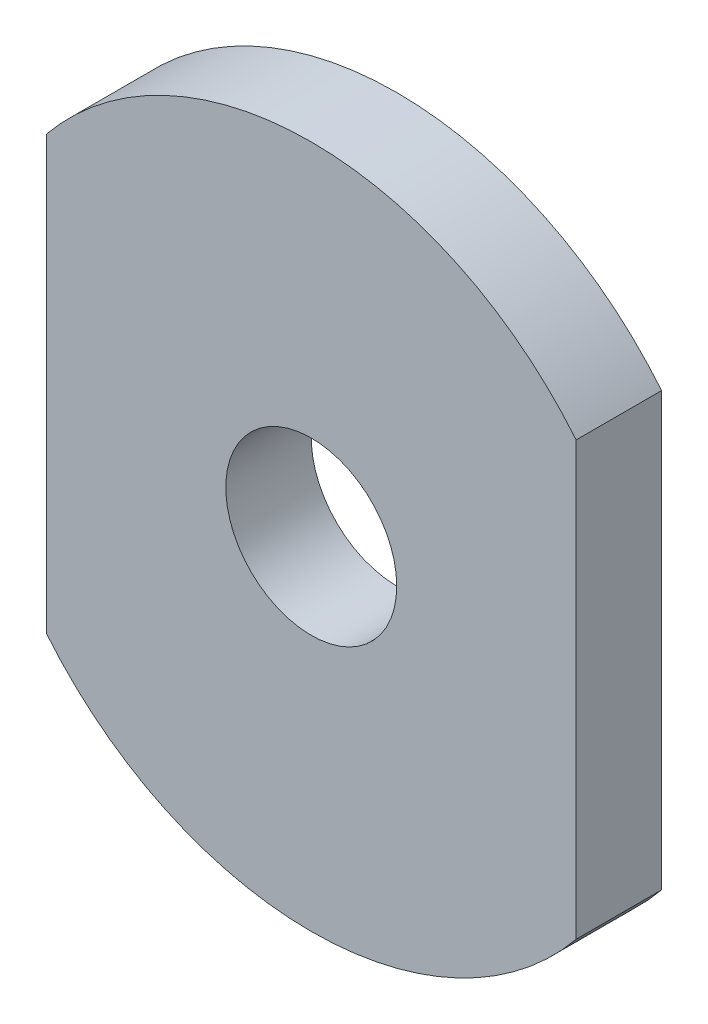
ISO-10303-21;
HEADER;
FILE_DESCRIPTION(('STEP AP214'),'2;1');
FILE_NAME('part.step','',(''),(''),'','','');
FILE_SCHEMA(('AUTOMOTIVE_DESIGN { 1 0 10303 214 1 1 1 1 }'));
ENDSEC;
DATA;
#1=APPLICATION_CONTEXT('core data for automotive mechanical design processes');
#2=APPLICATION_PROTOCOL_DEFINITION('international standard','automotive_design',2000,#1);
#3=PRODUCT_CONTEXT('',#1,'mechanical');
#4=PRODUCT('Part','Part','',(#3));
#5=PRODUCT_RELATED_PRODUCT_CATEGORY('part','',(#4));
#6=PRODUCT_DEFINITION_FORMATION('','',#4);
#7=PRODUCT_DEFINITION_CONTEXT('part definition',#1,'design');
#8=PRODUCT_DEFINITION('design','',#6,#7);
#9=PRODUCT_DEFINITION_SHAPE('','',#8);
#10=(LENGTH_UNIT() NAMED_UNIT(*) SI_UNIT(.MILLI.,.METRE.));
#11=(NAMED_UNIT(*) PLANE_ANGLE_UNIT() SI_UNIT($,.RADIAN.));
#12=(NAMED_UNIT(*) SI_UNIT($,.STERADIAN.) SOLID_ANGLE_UNIT());
#13=UNCERTAINTY_MEASURE_WITH_UNIT(LENGTH_MEASURE(1.E-05),#10,'distance_accuracy_value','');
#14=(GEOMETRIC_REPRESENTATION_CONTEXT(3) GLOBAL_UNCERTAINTY_ASSIGNED_CONTEXT((#13)) GLOBAL_UNIT_ASSIGNED_CONTEXT((#10,
#11,#12)) REPRESENTATION_CONTEXT('',''));
#15=CARTESIAN_POINT('',(0.,0.,0.));
#16=DIRECTION('',(0.,0.,1.));
#17=DIRECTION('',(1.,0.,0.));
#18=AXIS2_PLACEMENT_3D('',#15,#16,#17);
#19=CARTESIAN_POINT('',(0.,0.,5.));
#20=DIRECTION('',(0.,0.,1.));
#21=DIRECTION('',(1.,0.,0.));
#22=AXIS2_PLACEMENT_3D('',#19,#20,#21);
#23=PLANE('',#22);
#24=CARTESIAN_POINT('',(0.,0.,5.));
#25=DIRECTION('',(0.,0.,1.));
#26=DIRECTION('',(1.,0.,0.));
#27=AXIS2_PLACEMENT_3D('',#24,#25,#26);
#28=CIRCLE('',#27,20.);
#29=CARTESIAN_POINT('',(15.4927529048047,12.6481068714123,5.));
#30=VERTEX_POINT('',#29);
#31=CARTESIAN_POINT('',(-15.4927529048047,12.6481068714123,5.));
#32=VERTEX_POINT('',#31);
#33=EDGE_CURVE('E91',#30,#32,#28,.T.);
#34=ORIENTED_EDGE('',*,*,#33,.T.);
#35=DIRECTION('',(0.,-1.,0.));
#36=VECTOR('',#35,1.);
#37=CARTESIAN_POINT('',(-15.4927529048047,12.6481068714123,5.));
#38=LINE('',#37,#36);
#39=CARTESIAN_POINT('',(-15.4927529048047,-12.6481068714123,5.));
#40=VERTEX_POINT('',#39);
#41=EDGE_CURVE('E86',#32,#40,#38,.T.);
#42=ORIENTED_EDGE('',*,*,#41,.T.);
#43=CARTESIAN_POINT('',(0.,0.,5.));
#44=DIRECTION('',(0.,0.,1.));
#45=DIRECTION('',(1.,0.,0.));
#46=AXIS2_PLACEMENT_3D('',#43,#44,#45);
#47=CIRCLE('',#46,20.);
#48=CARTESIAN_POINT('',(15.4927529048047,-12.6481068714123,5.));
#49=VERTEX_POINT('',#48);
#50=EDGE_CURVE('E89',#40,#49,#47,.T.);
#51=ORIENTED_EDGE('',*,*,#50,.T.);
#52=DIRECTION('',(0.,1.,0.));
#53=VECTOR('',#52,1.);
#54=CARTESIAN_POINT('',(15.4927529048047,12.6481068714123,5.));
#55=LINE('',#54,#53);
#56=EDGE_CURVE('E56',#49,#30,#55,.T.);
#57=ORIENTED_EDGE('',*,*,#56,.T.);
#58=EDGE_LOOP('',(#34,#42,#51,#57));
#59=FACE_BOUND('',#58,.T.);
#60=CARTESIAN_POINT('',(0.,0.,5.));
#61=DIRECTION('',(0.,0.,1.));
#62=DIRECTION('',(1.,0.,0.));
#63=AXIS2_PLACEMENT_3D('',#60,#61,#62);
#64=CIRCLE('',#63,5.);
#65=CARTESIAN_POINT('',(5.,0.,5.));
#66=VERTEX_POINT('',#65);
#67=EDGE_CURVE('E106',#66,#66,#64,.T.);
#68=ORIENTED_EDGE('',*,*,#67,.F.);
#69=EDGE_LOOP('',(#68));
#70=FACE_BOUND('',#69,.T.);
#71=ADVANCED_FACE('F39',(#59,#70),#23,.T.);
#72=CARTESIAN_POINT('',(0.,0.,0.));
#73=DIRECTION('',(0.,0.,1.));
#74=DIRECTION('',(1.,0.,0.));
#75=AXIS2_PLACEMENT_3D('',#72,#73,#74);
#76=PLANE('',#75);
#77=CARTESIAN_POINT('',(0.,0.,0.));
#78=DIRECTION('',(0.,0.,1.));
#79=DIRECTION('',(1.,0.,0.));
#80=AXIS2_PLACEMENT_3D('',#77,#78,#79);
#81=CIRCLE('',#80,20.);
#82=CARTESIAN_POINT('',(15.4927529048047,12.6481068714123,0.));
#83=VERTEX_POINT('',#82);
#84=CARTESIAN_POINT('',(-15.4927529048047,12.6481068714123,0.));
#85=VERTEX_POINT('',#84);
#86=EDGE_CURVE('E103',#83,#85,#81,.T.);
#87=ORIENTED_EDGE('',*,*,#86,.F.);
#88=DIRECTION('',(0.,1.,0.));
#89=VECTOR('',#88,1.);
#90=CARTESIAN_POINT('',(15.4927529048047,12.6481068714123,0.));
#91=LINE('',#90,#89);
#92=CARTESIAN_POINT('',(15.4927529048047,-12.6481068714123,0.));
#93=VERTEX_POINT('',#92);
#94=EDGE_CURVE('E79',#93,#83,#91,.T.);
#95=ORIENTED_EDGE('',*,*,#94,.F.);
#96=CARTESIAN_POINT('',(0.,0.,0.));
#97=DIRECTION('',(0.,0.,1.));
#98=DIRECTION('',(1.,0.,0.));
#99=AXIS2_PLACEMENT_3D('',#96,#97,#98);
#100=CIRCLE('',#99,20.);
#101=CARTESIAN_POINT('',(-15.4927529048047,-12.6481068714123,0.));
#102=VERTEX_POINT('',#101);
#103=EDGE_CURVE('E73',#102,#93,#100,.T.);
#104=ORIENTED_EDGE('',*,*,#103,.F.);
#105=DIRECTION('',(0.,-1.,0.));
#106=VECTOR('',#105,1.);
#107=CARTESIAN_POINT('',(-15.4927529048047,12.6481068714123,0.));
#108=LINE('',#107,#106);
#109=EDGE_CURVE('E95',#85,#102,#108,.T.);
#110=ORIENTED_EDGE('',*,*,#109,.F.);
#111=EDGE_LOOP('',(#87,#95,#104,#110));
#112=FACE_BOUND('',#111,.T.);
#113=CARTESIAN_POINT('',(0.,0.,0.));
#114=DIRECTION('',(0.,0.,1.));
#115=DIRECTION('',(1.,0.,0.));
#116=AXIS2_PLACEMENT_3D('',#113,#114,#115);
#117=CIRCLE('',#116,5.);
#118=CARTESIAN_POINT('',(5.,0.,0.));
#119=VERTEX_POINT('',#118);
#120=EDGE_CURVE('E118',#119,#119,#117,.T.);
#121=ORIENTED_EDGE('',*,*,#120,.T.);
#122=EDGE_LOOP('',(#121));
#123=FACE_BOUND('',#122,.T.);
#124=ADVANCED_FACE('F114',(#112,#123),#76,.F.);
#125=CARTESIAN_POINT('',(0.,0.,5.));
#126=DIRECTION('',(0.,0.,-1.));
#127=DIRECTION('',(-1.,0.,0.));
#128=AXIS2_PLACEMENT_3D('',#125,#126,#127);
#129=CYLINDRICAL_SURFACE('',#128,20.);
#130=ORIENTED_EDGE('',*,*,#86,.T.);
#131=DIRECTION('',(0.,0.,-1.));
#132=VECTOR('',#131,1.);
#133=CARTESIAN_POINT('',(-15.4927529048047,12.6481068714123,5.));
#134=LINE('',#133,#132);
#135=EDGE_CURVE('E11',#32,#85,#134,.T.);
#136=ORIENTED_EDGE('',*,*,#135,.F.);
#137=ORIENTED_EDGE('',*,*,#33,.F.);
#138=DIRECTION('',(0.,0.,-1.));
#139=VECTOR('',#138,1.);
#140=CARTESIAN_POINT('',(15.4927529048047,12.6481068714123,5.));
#141=LINE('',#140,#139);
#142=EDGE_CURVE('E99',#30,#83,#141,.T.);
#143=ORIENTED_EDGE('',*,*,#142,.T.);
#144=EDGE_LOOP('',(#130,#136,#137,#143));
#145=FACE_BOUND('',#144,.T.);
#146=ADVANCED_FACE('F41',(#145),#129,.T.);
#147=CARTESIAN_POINT('',(-15.4927529048047,12.6481068714123,5.));
#148=DIRECTION('',(1.,0.,0.));
#149=DIRECTION('',(0.,0.,-1.));
#150=AXIS2_PLACEMENT_3D('',#147,#148,#149);
#151=PLANE('',#150);
#152=ORIENTED_EDGE('',*,*,#109,.T.);
#153=DIRECTION('',(0.,0.,-1.));
#154=VECTOR('',#153,1.);
#155=CARTESIAN_POINT('',(-15.4927529048047,-12.6481068714123,5.));
#156=LINE('',#155,#154);
#157=EDGE_CURVE('E48',#40,#102,#156,.T.);
#158=ORIENTED_EDGE('',*,*,#157,.F.);
#159=ORIENTED_EDGE('',*,*,#41,.F.);
#160=ORIENTED_EDGE('',*,*,#135,.T.);
#161=EDGE_LOOP('',(#152,#158,#159,#160));
#162=FACE_BOUND('',#161,.T.);
#163=ADVANCED_FACE('F94',(#162),#151,.F.);
#164=CARTESIAN_POINT('',(0.,0.,5.));
#165=DIRECTION('',(0.,0.,-1.));
#166=DIRECTION('',(-1.,0.,0.));
#167=AXIS2_PLACEMENT_3D('',#164,#165,#166);
#168=CYLINDRICAL_SURFACE('',#167,20.);
#169=ORIENTED_EDGE('',*,*,#103,.T.);
#170=DIRECTION('',(0.,0.,-1.));
#171=VECTOR('',#170,1.);
#172=CARTESIAN_POINT('',(15.4927529048047,-12.6481068714123,5.));
#173=LINE('',#172,#171);
#174=EDGE_CURVE('E96',#49,#93,#173,.T.);
#175=ORIENTED_EDGE('',*,*,#174,.F.);
#176=ORIENTED_EDGE('',*,*,#50,.F.);
#177=ORIENTED_EDGE('',*,*,#157,.T.);
#178=EDGE_LOOP('',(#169,#175,#176,#177));
#179=FACE_BOUND('',#178,.T.);
#180=ADVANCED_FACE('F97',(#179),#168,.T.);
#181=CARTESIAN_POINT('',(15.4927529048047,12.6481068714123,5.));
#182=DIRECTION('',(-1.,0.,0.));
#183=DIRECTION('',(0.,0.,1.));
#184=AXIS2_PLACEMENT_3D('',#181,#182,#183);
#185=PLANE('',#184);
#186=ORIENTED_EDGE('',*,*,#94,.T.);
#187=ORIENTED_EDGE('',*,*,#142,.F.);
#188=ORIENTED_EDGE('',*,*,#56,.F.);
#189=ORIENTED_EDGE('',*,*,#174,.T.);
#190=EDGE_LOOP('',(#186,#187,#188,#189));
#191=FACE_BOUND('',#190,.T.);
#192=ADVANCED_FACE('F111',(#191),#185,.F.);
#193=CARTESIAN_POINT('',(0.,0.,5.));
#194=DIRECTION('',(0.,0.,-1.));
#195=DIRECTION('',(-1.,0.,0.));
#196=AXIS2_PLACEMENT_3D('',#193,#194,#195);
#197=CYLINDRICAL_SURFACE('',#196,5.);
#198=ORIENTED_EDGE('',*,*,#67,.T.);
#199=EDGE_LOOP('',(#198));
#200=FACE_BOUND('',#199,.T.);
#201=ORIENTED_EDGE('',*,*,#120,.F.);
#202=EDGE_LOOP('',(#201));
#203=FACE_BOUND('',#202,.T.);
#204=ADVANCED_FACE('F124',(#200,#203),#197,.F.);
#205=CLOSED_SHELL('',(#71,#124,#146,#163,#180,#192,#204));
#206=MANIFOLD_SOLID_BREP('B2',#205);
#207=ADVANCED_BREP_SHAPE_REPRESENTATION('',(#18,#206),#14);
#208=SHAPE_DEFINITION_REPRESENTATION(#9,#207);
ENDSEC;
END-ISO-10303-21;
